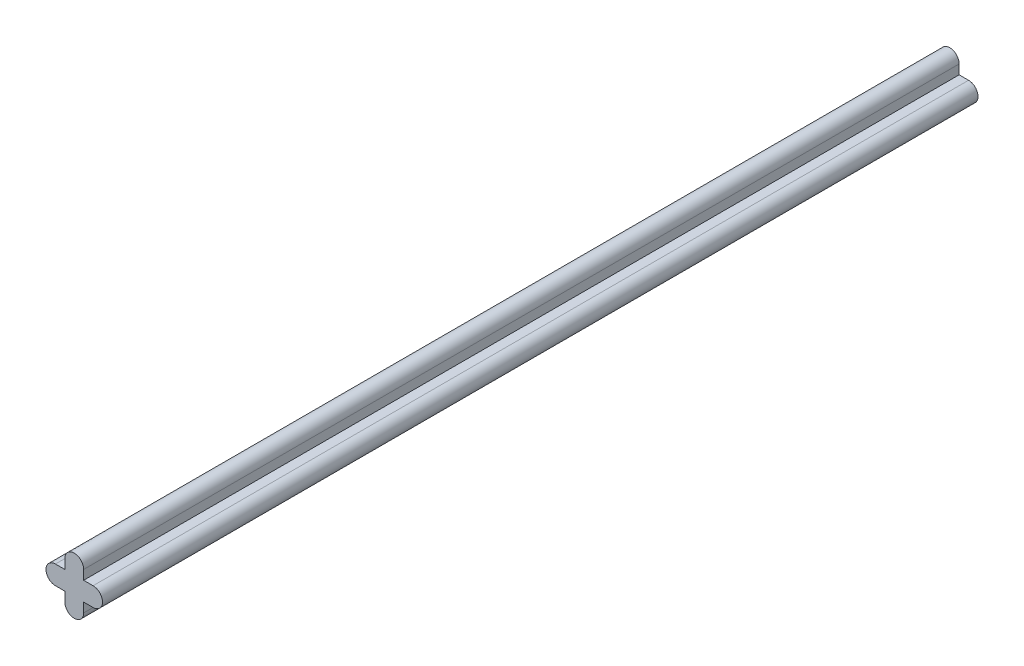
ISO-10303-21;
HEADER;
FILE_DESCRIPTION(('STEP AP214'),'2;1');
FILE_NAME('part.step','',(''),(''),'','','');
FILE_SCHEMA(('AUTOMOTIVE_DESIGN { 1 0 10303 214 1 1 1 1 }'));
ENDSEC;
DATA;
#1=APPLICATION_CONTEXT('core data for automotive mechanical design processes');
#2=APPLICATION_PROTOCOL_DEFINITION('international standard','automotive_design',2000,#1);
#3=PRODUCT_CONTEXT('',#1,'mechanical');
#4=PRODUCT('Part','Part','',(#3));
#5=PRODUCT_RELATED_PRODUCT_CATEGORY('part','',(#4));
#6=PRODUCT_DEFINITION_FORMATION('','',#4);
#7=PRODUCT_DEFINITION_CONTEXT('part definition',#1,'design');
#8=PRODUCT_DEFINITION('design','',#6,#7);
#9=PRODUCT_DEFINITION_SHAPE('','',#8);
#10=(LENGTH_UNIT() NAMED_UNIT(*) SI_UNIT(.MILLI.,.METRE.));
#11=(NAMED_UNIT(*) PLANE_ANGLE_UNIT() SI_UNIT($,.RADIAN.));
#12=(NAMED_UNIT(*) SI_UNIT($,.STERADIAN.) SOLID_ANGLE_UNIT());
#13=UNCERTAINTY_MEASURE_WITH_UNIT(LENGTH_MEASURE(1.E-05),#10,'distance_accuracy_value','');
#14=(GEOMETRIC_REPRESENTATION_CONTEXT(3) GLOBAL_UNCERTAINTY_ASSIGNED_CONTEXT((#13)) GLOBAL_UNIT_ASSIGNED_CONTEXT((#10,
#11,#12)) REPRESENTATION_CONTEXT('',''));
#15=CARTESIAN_POINT('',(0.,0.,0.));
#16=DIRECTION('',(0.,0.,1.));
#17=DIRECTION('',(1.,0.,0.));
#18=AXIS2_PLACEMENT_3D('',#15,#16,#17);
#19=CARTESIAN_POINT('',(0.,0.762,70.866));
#20=DIRECTION('',(0.,1.,0.));
#21=DIRECTION('',(-1.,0.,0.));
#22=AXIS2_PLACEMENT_3D('',#19,#20,#21);
#23=PLANE('',#22);
#24=DIRECTION('',(1.,0.,0.));
#25=VECTOR('',#24,1.);
#26=CARTESIAN_POINT('',(0.,0.762,0.));
#27=LINE('',#26,#25);
#28=CARTESIAN_POINT('',(-1.524,0.762,0.));
#29=VERTEX_POINT('',#28);
#30=CARTESIAN_POINT('',(-0.761999999999999,0.762,0.));
#31=VERTEX_POINT('',#30);
#32=EDGE_CURVE('E153',#29,#31,#27,.T.);
#33=ORIENTED_EDGE('',*,*,#32,.F.);
#34=DIRECTION('',(0.,0.,-1.));
#35=VECTOR('',#34,1.);
#36=CARTESIAN_POINT('',(-1.524,0.762,70.866));
#37=LINE('',#36,#35);
#38=CARTESIAN_POINT('',(-1.524,0.762,70.866));
#39=VERTEX_POINT('',#38);
#40=EDGE_CURVE('E11',#39,#29,#37,.T.);
#41=ORIENTED_EDGE('',*,*,#40,.F.);
#42=DIRECTION('',(1.,0.,0.));
#43=VECTOR('',#42,1.);
#44=CARTESIAN_POINT('',(0.,0.762,70.866));
#45=LINE('',#44,#43);
#46=CARTESIAN_POINT('',(-0.761999999999999,0.762,70.866));
#47=VERTEX_POINT('',#46);
#48=EDGE_CURVE('E180',#39,#47,#45,.T.);
#49=ORIENTED_EDGE('',*,*,#48,.T.);
#50=DIRECTION('',(0.,0.,-1.));
#51=VECTOR('',#50,1.);
#52=CARTESIAN_POINT('',(-0.761999999999999,0.762,70.866));
#53=LINE('',#52,#51);
#54=EDGE_CURVE('E97',#47,#31,#53,.T.);
#55=ORIENTED_EDGE('',*,*,#54,.T.);
#56=EDGE_LOOP('',(#33,#41,#49,#55));
#57=FACE_BOUND('',#56,.T.);
#58=ADVANCED_FACE('F35',(#57),#23,.T.);
#59=CARTESIAN_POINT('',(-1.524,0.,70.866));
#60=DIRECTION('',(0.,0.,-1.));
#61=DIRECTION('',(-1.,0.,0.));
#62=AXIS2_PLACEMENT_3D('',#59,#60,#61);
#63=CYLINDRICAL_SURFACE('',#62,0.762);
#64=CARTESIAN_POINT('',(-1.524,0.,0.));
#65=DIRECTION('',(0.,0.,1.));
#66=DIRECTION('',(1.,0.,0.));
#67=AXIS2_PLACEMENT_3D('',#64,#65,#66);
#68=CIRCLE('',#67,0.762);
#69=CARTESIAN_POINT('',(-1.524,-0.762,0.));
#70=VERTEX_POINT('',#69);
#71=EDGE_CURVE('E156',#29,#70,#68,.T.);
#72=ORIENTED_EDGE('',*,*,#71,.T.);
#73=DIRECTION('',(0.,0.,-1.));
#74=VECTOR('',#73,1.);
#75=CARTESIAN_POINT('',(-1.524,-0.762,70.866));
#76=LINE('',#75,#74);
#77=CARTESIAN_POINT('',(-1.524,-0.762,70.866));
#78=VERTEX_POINT('',#77);
#79=EDGE_CURVE('E43',#78,#70,#76,.T.);
#80=ORIENTED_EDGE('',*,*,#79,.F.);
#81=CARTESIAN_POINT('',(-1.524,0.,70.866));
#82=DIRECTION('',(0.,0.,1.));
#83=DIRECTION('',(1.,0.,0.));
#84=AXIS2_PLACEMENT_3D('',#81,#82,#83);
#85=CIRCLE('',#84,0.762);
#86=EDGE_CURVE('E244',#39,#78,#85,.T.);
#87=ORIENTED_EDGE('',*,*,#86,.F.);
#88=ORIENTED_EDGE('',*,*,#40,.T.);
#89=EDGE_LOOP('',(#72,#80,#87,#88));
#90=FACE_BOUND('',#89,.T.);
#91=ADVANCED_FACE('F247',(#90),#63,.T.);
#92=CARTESIAN_POINT('',(0.,-0.762,70.866));
#93=DIRECTION('',(0.,1.,0.));
#94=DIRECTION('',(-1.,0.,0.));
#95=AXIS2_PLACEMENT_3D('',#92,#93,#94);
#96=PLANE('',#95);
#97=DIRECTION('',(1.,0.,0.));
#98=VECTOR('',#97,1.);
#99=CARTESIAN_POINT('',(0.,-0.762,0.));
#100=LINE('',#99,#98);
#101=CARTESIAN_POINT('',(-0.761999999999999,-0.762,0.));
#102=VERTEX_POINT('',#101);
#103=EDGE_CURVE('E158',#70,#102,#100,.T.);
#104=ORIENTED_EDGE('',*,*,#103,.T.);
#105=DIRECTION('',(0.,0.,-1.));
#106=VECTOR('',#105,1.);
#107=CARTESIAN_POINT('',(-0.761999999999999,-0.762,70.866));
#108=LINE('',#107,#106);
#109=CARTESIAN_POINT('',(-0.761999999999999,-0.762,70.866));
#110=VERTEX_POINT('',#109);
#111=EDGE_CURVE('E196',#110,#102,#108,.T.);
#112=ORIENTED_EDGE('',*,*,#111,.F.);
#113=DIRECTION('',(1.,0.,0.));
#114=VECTOR('',#113,1.);
#115=CARTESIAN_POINT('',(0.,-0.762,70.866));
#116=LINE('',#115,#114);
#117=EDGE_CURVE('E205',#78,#110,#116,.T.);
#118=ORIENTED_EDGE('',*,*,#117,.F.);
#119=ORIENTED_EDGE('',*,*,#79,.T.);
#120=EDGE_LOOP('',(#104,#112,#118,#119));
#121=FACE_BOUND('',#120,.T.);
#122=ADVANCED_FACE('F203',(#121),#96,.F.);
#123=CARTESIAN_POINT('',(-0.761999999999999,0.,70.866));
#124=DIRECTION('',(1.,0.,0.));
#125=DIRECTION('',(0.,0.,-1.));
#126=AXIS2_PLACEMENT_3D('',#123,#124,#125);
#127=PLANE('',#126);
#128=DIRECTION('',(0.,-1.,0.));
#129=VECTOR('',#128,1.);
#130=CARTESIAN_POINT('',(-0.761999999999999,0.,0.));
#131=LINE('',#130,#129);
#132=CARTESIAN_POINT('',(-0.761999999999999,-1.524,0.));
#133=VERTEX_POINT('',#132);
#134=EDGE_CURVE('E160',#102,#133,#131,.T.);
#135=ORIENTED_EDGE('',*,*,#134,.T.);
#136=DIRECTION('',(0.,0.,-1.));
#137=VECTOR('',#136,1.);
#138=CARTESIAN_POINT('',(-0.761999999999999,-1.524,70.866));
#139=LINE('',#138,#137);
#140=CARTESIAN_POINT('',(-0.761999999999999,-1.524,70.866));
#141=VERTEX_POINT('',#140);
#142=EDGE_CURVE('E193',#141,#133,#139,.T.);
#143=ORIENTED_EDGE('',*,*,#142,.F.);
#144=DIRECTION('',(0.,-1.,0.));
#145=VECTOR('',#144,1.);
#146=CARTESIAN_POINT('',(-0.761999999999999,0.,70.866));
#147=LINE('',#146,#145);
#148=EDGE_CURVE('E224',#110,#141,#147,.T.);
#149=ORIENTED_EDGE('',*,*,#148,.F.);
#150=ORIENTED_EDGE('',*,*,#111,.T.);
#151=EDGE_LOOP('',(#135,#143,#149,#150));
#152=FACE_BOUND('',#151,.T.);
#153=ADVANCED_FACE('F214',(#152),#127,.F.);
#154=CARTESIAN_POINT('',(0.,-1.524,70.866));
#155=DIRECTION('',(0.,0.,-1.));
#156=DIRECTION('',(-1.,0.,0.));
#157=AXIS2_PLACEMENT_3D('',#154,#155,#156);
#158=CYLINDRICAL_SURFACE('',#157,0.762);
#159=CARTESIAN_POINT('',(0.,-1.524,0.));
#160=DIRECTION('',(0.,0.,1.));
#161=DIRECTION('',(1.,0.,0.));
#162=AXIS2_PLACEMENT_3D('',#159,#160,#161);
#163=CIRCLE('',#162,0.762);
#164=CARTESIAN_POINT('',(0.762000000000001,-1.524,0.));
#165=VERTEX_POINT('',#164);
#166=EDGE_CURVE('E162',#133,#165,#163,.T.);
#167=ORIENTED_EDGE('',*,*,#166,.T.);
#168=DIRECTION('',(0.,0.,-1.));
#169=VECTOR('',#168,1.);
#170=CARTESIAN_POINT('',(0.762000000000001,-1.524,70.866));
#171=LINE('',#170,#169);
#172=CARTESIAN_POINT('',(0.762000000000001,-1.524,70.866));
#173=VERTEX_POINT('',#172);
#174=EDGE_CURVE('E191',#173,#165,#171,.T.);
#175=ORIENTED_EDGE('',*,*,#174,.F.);
#176=CARTESIAN_POINT('',(0.,-1.524,70.866));
#177=DIRECTION('',(0.,0.,1.));
#178=DIRECTION('',(1.,0.,0.));
#179=AXIS2_PLACEMENT_3D('',#176,#177,#178);
#180=CIRCLE('',#179,0.762);
#181=EDGE_CURVE('E220',#141,#173,#180,.T.);
#182=ORIENTED_EDGE('',*,*,#181,.F.);
#183=ORIENTED_EDGE('',*,*,#142,.T.);
#184=EDGE_LOOP('',(#167,#175,#182,#183));
#185=FACE_BOUND('',#184,.T.);
#186=ADVANCED_FACE('F218',(#185),#158,.T.);
#187=CARTESIAN_POINT('',(0.762000000000001,0.,70.866));
#188=DIRECTION('',(1.,0.,0.));
#189=DIRECTION('',(0.,0.,-1.));
#190=AXIS2_PLACEMENT_3D('',#187,#188,#189);
#191=PLANE('',#190);
#192=DIRECTION('',(0.,-1.,0.));
#193=VECTOR('',#192,1.);
#194=CARTESIAN_POINT('',(0.762000000000001,0.,0.));
#195=LINE('',#194,#193);
#196=CARTESIAN_POINT('',(0.762000000000001,-0.761999999999999,0.));
#197=VERTEX_POINT('',#196);
#198=EDGE_CURVE('E165',#197,#165,#195,.T.);
#199=ORIENTED_EDGE('',*,*,#198,.F.);
#200=DIRECTION('',(0.,0.,-1.));
#201=VECTOR('',#200,1.);
#202=CARTESIAN_POINT('',(0.762000000000001,-0.761999999999999,70.866));
#203=LINE('',#202,#201);
#204=CARTESIAN_POINT('',(0.762000000000001,-0.761999999999999,70.866));
#205=VERTEX_POINT('',#204);
#206=EDGE_CURVE('E189',#205,#197,#203,.T.);
#207=ORIENTED_EDGE('',*,*,#206,.F.);
#208=DIRECTION('',(0.,-1.,0.));
#209=VECTOR('',#208,1.);
#210=CARTESIAN_POINT('',(0.762000000000001,0.,70.866));
#211=LINE('',#210,#209);
#212=EDGE_CURVE('E223',#205,#173,#211,.T.);
#213=ORIENTED_EDGE('',*,*,#212,.T.);
#214=ORIENTED_EDGE('',*,*,#174,.T.);
#215=EDGE_LOOP('',(#199,#207,#213,#214));
#216=FACE_BOUND('',#215,.T.);
#217=ADVANCED_FACE('F259',(#216),#191,.T.);
#218=CARTESIAN_POINT('',(0.,-0.762,70.866));
#219=DIRECTION('',(0.,1.,0.));
#220=DIRECTION('',(-1.,0.,0.));
#221=AXIS2_PLACEMENT_3D('',#218,#219,#220);
#222=PLANE('',#221);
#223=DIRECTION('',(1.,0.,0.));
#224=VECTOR('',#223,1.);
#225=CARTESIAN_POINT('',(0.,-0.762,0.));
#226=LINE('',#225,#224);
#227=CARTESIAN_POINT('',(1.524,-0.761999999999999,0.));
#228=VERTEX_POINT('',#227);
#229=EDGE_CURVE('E168',#197,#228,#226,.T.);
#230=ORIENTED_EDGE('',*,*,#229,.T.);
#231=DIRECTION('',(0.,0.,-1.));
#232=VECTOR('',#231,1.);
#233=CARTESIAN_POINT('',(1.524,-0.761999999999999,70.866));
#234=LINE('',#233,#232);
#235=CARTESIAN_POINT('',(1.524,-0.761999999999999,70.866));
#236=VERTEX_POINT('',#235);
#237=EDGE_CURVE('E186',#236,#228,#234,.T.);
#238=ORIENTED_EDGE('',*,*,#237,.F.);
#239=DIRECTION('',(1.,0.,0.));
#240=VECTOR('',#239,1.);
#241=CARTESIAN_POINT('',(0.,-0.762,70.866));
#242=LINE('',#241,#240);
#243=EDGE_CURVE('E226',#205,#236,#242,.T.);
#244=ORIENTED_EDGE('',*,*,#243,.F.);
#245=ORIENTED_EDGE('',*,*,#206,.T.);
#246=EDGE_LOOP('',(#230,#238,#244,#245));
#247=FACE_BOUND('',#246,.T.);
#248=ADVANCED_FACE('F262',(#247),#222,.F.);
#249=CARTESIAN_POINT('',(1.524,0.,70.866));
#250=DIRECTION('',(0.,0.,-1.));
#251=DIRECTION('',(-1.,0.,0.));
#252=AXIS2_PLACEMENT_3D('',#249,#250,#251);
#253=CYLINDRICAL_SURFACE('',#252,0.762);
#254=CARTESIAN_POINT('',(1.524,0.,0.));
#255=DIRECTION('',(0.,0.,1.));
#256=DIRECTION('',(1.,0.,0.));
#257=AXIS2_PLACEMENT_3D('',#254,#255,#256);
#258=CIRCLE('',#257,0.762);
#259=CARTESIAN_POINT('',(1.524,0.762000000000001,0.));
#260=VERTEX_POINT('',#259);
#261=EDGE_CURVE('E170',#228,#260,#258,.T.);
#262=ORIENTED_EDGE('',*,*,#261,.T.);
#263=DIRECTION('',(0.,0.,-1.));
#264=VECTOR('',#263,1.);
#265=CARTESIAN_POINT('',(1.524,0.762000000000001,70.866));
#266=LINE('',#265,#264);
#267=CARTESIAN_POINT('',(1.524,0.762000000000001,70.866));
#268=VERTEX_POINT('',#267);
#269=EDGE_CURVE('E184',#268,#260,#266,.T.);
#270=ORIENTED_EDGE('',*,*,#269,.F.);
#271=CARTESIAN_POINT('',(1.524,0.,70.866));
#272=DIRECTION('',(0.,0.,1.));
#273=DIRECTION('',(1.,0.,0.));
#274=AXIS2_PLACEMENT_3D('',#271,#272,#273);
#275=CIRCLE('',#274,0.762);
#276=EDGE_CURVE('E148',#236,#268,#275,.T.);
#277=ORIENTED_EDGE('',*,*,#276,.F.);
#278=ORIENTED_EDGE('',*,*,#237,.T.);
#279=EDGE_LOOP('',(#262,#270,#277,#278));
#280=FACE_BOUND('',#279,.T.);
#281=ADVANCED_FACE('F236',(#280),#253,.T.);
#282=CARTESIAN_POINT('',(0.,0.762,70.866));
#283=DIRECTION('',(0.,1.,0.));
#284=DIRECTION('',(-1.,0.,0.));
#285=AXIS2_PLACEMENT_3D('',#282,#283,#284);
#286=PLANE('',#285);
#287=DIRECTION('',(1.,0.,0.));
#288=VECTOR('',#287,1.);
#289=CARTESIAN_POINT('',(0.,0.762,0.));
#290=LINE('',#289,#288);
#291=CARTESIAN_POINT('',(0.762000000000001,0.762000000000001,0.));
#292=VERTEX_POINT('',#291);
#293=EDGE_CURVE('E173',#292,#260,#290,.T.);
#294=ORIENTED_EDGE('',*,*,#293,.F.);
#295=DIRECTION('',(0.,0.,-1.));
#296=VECTOR('',#295,1.);
#297=CARTESIAN_POINT('',(0.762000000000001,0.762000000000001,70.866));
#298=LINE('',#297,#296);
#299=CARTESIAN_POINT('',(0.762000000000001,0.762000000000001,70.866));
#300=VERTEX_POINT('',#299);
#301=EDGE_CURVE('E137',#300,#292,#298,.T.);
#302=ORIENTED_EDGE('',*,*,#301,.F.);
#303=DIRECTION('',(1.,0.,0.));
#304=VECTOR('',#303,1.);
#305=CARTESIAN_POINT('',(0.,0.762,70.866));
#306=LINE('',#305,#304);
#307=EDGE_CURVE('E146',#300,#268,#306,.T.);
#308=ORIENTED_EDGE('',*,*,#307,.T.);
#309=ORIENTED_EDGE('',*,*,#269,.T.);
#310=EDGE_LOOP('',(#294,#302,#308,#309));
#311=FACE_BOUND('',#310,.T.);
#312=ADVANCED_FACE('F240',(#311),#286,.T.);
#313=CARTESIAN_POINT('',(0.762000000000001,0.,70.866));
#314=DIRECTION('',(1.,0.,0.));
#315=DIRECTION('',(0.,0.,-1.));
#316=AXIS2_PLACEMENT_3D('',#313,#314,#315);
#317=PLANE('',#316);
#318=DIRECTION('',(0.,-1.,0.));
#319=VECTOR('',#318,1.);
#320=CARTESIAN_POINT('',(0.762000000000001,0.,0.));
#321=LINE('',#320,#319);
#322=CARTESIAN_POINT('',(0.762000000000001,1.524,0.));
#323=VERTEX_POINT('',#322);
#324=EDGE_CURVE('E136',#323,#292,#321,.T.);
#325=ORIENTED_EDGE('',*,*,#324,.F.);
#326=DIRECTION('',(0.,0.,-1.));
#327=VECTOR('',#326,1.);
#328=CARTESIAN_POINT('',(0.762000000000001,1.524,70.866));
#329=LINE('',#328,#327);
#330=CARTESIAN_POINT('',(0.762000000000001,1.524,70.866));
#331=VERTEX_POINT('',#330);
#332=EDGE_CURVE('E130',#331,#323,#329,.T.);
#333=ORIENTED_EDGE('',*,*,#332,.F.);
#334=DIRECTION('',(0.,-1.,0.));
#335=VECTOR('',#334,1.);
#336=CARTESIAN_POINT('',(0.762000000000001,0.,70.866));
#337=LINE('',#336,#335);
#338=EDGE_CURVE('E134',#331,#300,#337,.T.);
#339=ORIENTED_EDGE('',*,*,#338,.T.);
#340=ORIENTED_EDGE('',*,*,#301,.T.);
#341=EDGE_LOOP('',(#325,#333,#339,#340));
#342=FACE_BOUND('',#341,.T.);
#343=ADVANCED_FACE('F132',(#342),#317,.T.);
#344=CARTESIAN_POINT('',(0.,1.524,70.866));
#345=DIRECTION('',(0.,0.,-1.));
#346=DIRECTION('',(-1.,0.,0.));
#347=AXIS2_PLACEMENT_3D('',#344,#345,#346);
#348=CYLINDRICAL_SURFACE('',#347,0.762);
#349=CARTESIAN_POINT('',(0.,1.524,0.));
#350=DIRECTION('',(0.,0.,1.));
#351=DIRECTION('',(1.,0.,0.));
#352=AXIS2_PLACEMENT_3D('',#349,#350,#351);
#353=CIRCLE('',#352,0.762);
#354=CARTESIAN_POINT('',(-0.761999999999999,1.524,0.));
#355=VERTEX_POINT('',#354);
#356=EDGE_CURVE('E90',#323,#355,#353,.T.);
#357=ORIENTED_EDGE('',*,*,#356,.T.);
#358=DIRECTION('',(0.,0.,-1.));
#359=VECTOR('',#358,1.);
#360=CARTESIAN_POINT('',(-0.761999999999999,1.524,70.866));
#361=LINE('',#360,#359);
#362=CARTESIAN_POINT('',(-0.761999999999999,1.524,70.866));
#363=VERTEX_POINT('',#362);
#364=EDGE_CURVE('E138',#363,#355,#361,.T.);
#365=ORIENTED_EDGE('',*,*,#364,.F.);
#366=CARTESIAN_POINT('',(0.,1.524,70.866));
#367=DIRECTION('',(0.,0.,1.));
#368=DIRECTION('',(1.,0.,0.));
#369=AXIS2_PLACEMENT_3D('',#366,#367,#368);
#370=CIRCLE('',#369,0.762);
#371=EDGE_CURVE('E140',#331,#363,#370,.T.);
#372=ORIENTED_EDGE('',*,*,#371,.F.);
#373=ORIENTED_EDGE('',*,*,#332,.T.);
#374=EDGE_LOOP('',(#357,#365,#372,#373));
#375=FACE_BOUND('',#374,.T.);
#376=ADVANCED_FACE('F141',(#375),#348,.T.);
#377=CARTESIAN_POINT('',(-0.761999999999999,0.,70.866));
#378=DIRECTION('',(1.,0.,0.));
#379=DIRECTION('',(0.,0.,-1.));
#380=AXIS2_PLACEMENT_3D('',#377,#378,#379);
#381=PLANE('',#380);
#382=DIRECTION('',(0.,-1.,0.));
#383=VECTOR('',#382,1.);
#384=CARTESIAN_POINT('',(-0.761999999999999,0.,0.));
#385=LINE('',#384,#383);
#386=EDGE_CURVE('E178',#355,#31,#385,.T.);
#387=ORIENTED_EDGE('',*,*,#386,.T.);
#388=ORIENTED_EDGE('',*,*,#54,.F.);
#389=DIRECTION('',(0.,-1.,0.));
#390=VECTOR('',#389,1.);
#391=CARTESIAN_POINT('',(-0.761999999999999,0.,70.866));
#392=LINE('',#391,#390);
#393=EDGE_CURVE('E51',#363,#47,#392,.T.);
#394=ORIENTED_EDGE('',*,*,#393,.F.);
#395=ORIENTED_EDGE('',*,*,#364,.T.);
#396=EDGE_LOOP('',(#387,#388,#394,#395));
#397=FACE_BOUND('',#396,.T.);
#398=ADVANCED_FACE('F243',(#397),#381,.F.);
#399=CARTESIAN_POINT('',(0.,0.,70.866));
#400=DIRECTION('',(0.,0.,1.));
#401=DIRECTION('',(1.,0.,0.));
#402=AXIS2_PLACEMENT_3D('',#399,#400,#401);
#403=PLANE('',#402);
#404=ORIENTED_EDGE('',*,*,#48,.F.);
#405=ORIENTED_EDGE('',*,*,#86,.T.);
#406=ORIENTED_EDGE('',*,*,#117,.T.);
#407=ORIENTED_EDGE('',*,*,#148,.T.);
#408=ORIENTED_EDGE('',*,*,#181,.T.);
#409=ORIENTED_EDGE('',*,*,#212,.F.);
#410=ORIENTED_EDGE('',*,*,#243,.T.);
#411=ORIENTED_EDGE('',*,*,#276,.T.);
#412=ORIENTED_EDGE('',*,*,#307,.F.);
#413=ORIENTED_EDGE('',*,*,#338,.F.);
#414=ORIENTED_EDGE('',*,*,#371,.T.);
#415=ORIENTED_EDGE('',*,*,#393,.T.);
#416=EDGE_LOOP('',(#404,#405,#406,#407,#408,#409,#410,#411,#412,#413,#414,#415));
#417=FACE_BOUND('',#416,.T.);
#418=ADVANCED_FACE('F144',(#417),#403,.T.);
#419=CARTESIAN_POINT('',(0.,0.,0.));
#420=DIRECTION('',(0.,0.,1.));
#421=DIRECTION('',(1.,0.,0.));
#422=AXIS2_PLACEMENT_3D('',#419,#420,#421);
#423=PLANE('',#422);
#424=ORIENTED_EDGE('',*,*,#32,.T.);
#425=ORIENTED_EDGE('',*,*,#386,.F.);
#426=ORIENTED_EDGE('',*,*,#356,.F.);
#427=ORIENTED_EDGE('',*,*,#324,.T.);
#428=ORIENTED_EDGE('',*,*,#293,.T.);
#429=ORIENTED_EDGE('',*,*,#261,.F.);
#430=ORIENTED_EDGE('',*,*,#229,.F.);
#431=ORIENTED_EDGE('',*,*,#198,.T.);
#432=ORIENTED_EDGE('',*,*,#166,.F.);
#433=ORIENTED_EDGE('',*,*,#134,.F.);
#434=ORIENTED_EDGE('',*,*,#103,.F.);
#435=ORIENTED_EDGE('',*,*,#71,.F.);
#436=EDGE_LOOP('',(#424,#425,#426,#427,#428,#429,#430,#431,#432,#433,#434,#435));
#437=FACE_BOUND('',#436,.T.);
#438=ADVANCED_FACE('F210',(#437),#423,.F.);
#439=CLOSED_SHELL('',(#58,#91,#122,#153,#186,#217,#248,#281,#312,#343,#376,#398,#418,#438));
#440=MANIFOLD_SOLID_BREP('B2',#439);
#441=ADVANCED_BREP_SHAPE_REPRESENTATION('',(#18,#440),#14);
#442=SHAPE_DEFINITION_REPRESENTATION(#9,#441);
ENDSEC;
END-ISO-10303-21;
